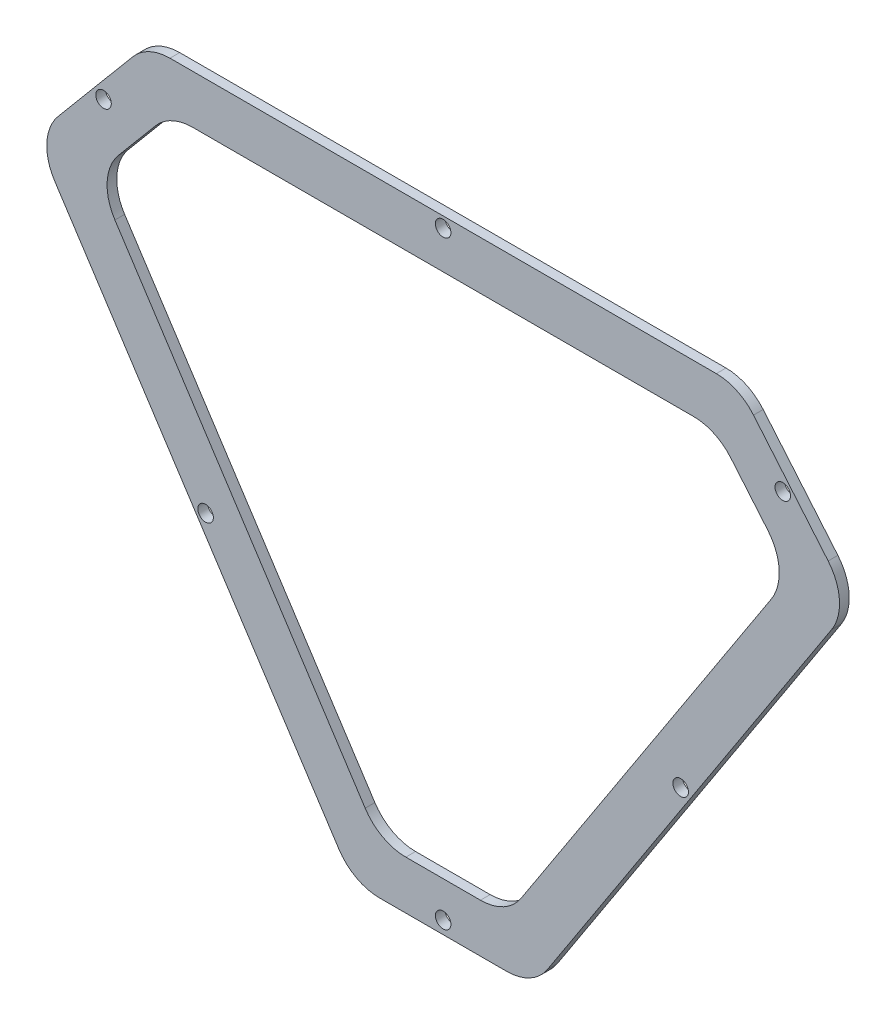
ISO-10303-21;
HEADER;
FILE_DESCRIPTION(('STEP AP214'),'2;1');
FILE_NAME('part.step','',(''),(''),'','','');
FILE_SCHEMA(('AUTOMOTIVE_DESIGN { 1 0 10303 214 1 1 1 1 }'));
ENDSEC;
DATA;
#1=APPLICATION_CONTEXT('core data for automotive mechanical design processes');
#2=APPLICATION_PROTOCOL_DEFINITION('international standard','automotive_design',2000,#1);
#3=PRODUCT_CONTEXT('',#1,'mechanical');
#4=PRODUCT('Part','Part','',(#3));
#5=PRODUCT_RELATED_PRODUCT_CATEGORY('part','',(#4));
#6=PRODUCT_DEFINITION_FORMATION('','',#4);
#7=PRODUCT_DEFINITION_CONTEXT('part definition',#1,'design');
#8=PRODUCT_DEFINITION('design','',#6,#7);
#9=PRODUCT_DEFINITION_SHAPE('','',#8);
#10=(LENGTH_UNIT() NAMED_UNIT(*) SI_UNIT(.MILLI.,.METRE.));
#11=(NAMED_UNIT(*) PLANE_ANGLE_UNIT() SI_UNIT($,.RADIAN.));
#12=(NAMED_UNIT(*) SI_UNIT($,.STERADIAN.) SOLID_ANGLE_UNIT());
#13=UNCERTAINTY_MEASURE_WITH_UNIT(LENGTH_MEASURE(1.E-05),#10,'distance_accuracy_value','');
#14=(GEOMETRIC_REPRESENTATION_CONTEXT(3) GLOBAL_UNCERTAINTY_ASSIGNED_CONTEXT((#13)) GLOBAL_UNIT_ASSIGNED_CONTEXT((#10,
#11,#12)) REPRESENTATION_CONTEXT('',''));
#15=CARTESIAN_POINT('',(0.,0.,0.));
#16=DIRECTION('',(0.,0.,1.));
#17=DIRECTION('',(1.,0.,0.));
#18=AXIS2_PLACEMENT_3D('',#15,#16,#17);
#19=CARTESIAN_POINT('',(-64.0302770326961,7.02578227157322,2.));
#20=DIRECTION('',(0.76604444311898,-0.642787609686537,0.));
#21=DIRECTION('',(0.642787609686537,0.76604444311898,0.));
#22=AXIS2_PLACEMENT_3D('',#19,#20,#21);
#23=PLANE('',#22);
#24=DIRECTION('',(-0.642787609686537,-0.76604444311898,0.));
#25=VECTOR('',#24,1.);
#26=CARTESIAN_POINT('',(-64.0302770326961,7.02578227157322,2.));
#27=LINE('',#26,#25);
#28=CARTESIAN_POINT('',(-43.8769392376704,31.0435949915599,2.));
#29=VERTEX_POINT('',#28);
#30=CARTESIAN_POINT('',(-59.2676486920447,12.7016617067355,2.));
#31=VERTEX_POINT('',#30);
#32=EDGE_CURVE('E216',#29,#31,#27,.T.);
#33=ORIENTED_EDGE('',*,*,#32,.F.);
#34=DIRECTION('',(0.,0.,-1.));
#35=VECTOR('',#34,1.);
#36=CARTESIAN_POINT('',(-43.8769392376704,31.0435949915599,2.));
#37=LINE('',#36,#35);
#38=CARTESIAN_POINT('',(-43.8769392376704,31.0435949915599,0.));
#39=VERTEX_POINT('',#38);
#40=EDGE_CURVE('E201',#29,#39,#37,.T.);
#41=ORIENTED_EDGE('',*,*,#40,.T.);
#42=DIRECTION('',(-0.642787609686537,-0.76604444311898,0.));
#43=VECTOR('',#42,1.);
#44=CARTESIAN_POINT('',(-64.0302770326961,7.02578227157322,0.));
#45=LINE('',#44,#43);
#46=CARTESIAN_POINT('',(-59.2676486920447,12.7016617067355,0.));
#47=VERTEX_POINT('',#46);
#48=EDGE_CURVE('E213',#39,#47,#45,.T.);
#49=ORIENTED_EDGE('',*,*,#48,.T.);
#50=DIRECTION('',(0.,0.,-1.));
#51=VECTOR('',#50,1.);
#52=CARTESIAN_POINT('',(-59.2676486920447,12.7016617067355,2.));
#53=LINE('',#52,#51);
#54=EDGE_CURVE('E218',#47,#31,#53,.F.);
#55=ORIENTED_EDGE('',*,*,#54,.T.);
#56=EDGE_LOOP('',(#33,#41,#49,#55));
#57=FACE_BOUND('',#56,.T.);
#58=ADVANCED_FACE('F33',(#57),#23,.F.);
#59=CARTESIAN_POINT('',(1.54524915373525,-93.6745327572285,2.));
#60=DIRECTION('',(0.837985801090183,0.545692035099692,0.));
#61=DIRECTION('',(-0.545692035099692,0.837985801090183,0.));
#62=AXIS2_PLACEMENT_3D('',#59,#60,#61);
#63=PLANE('',#62);
#64=DIRECTION('',(0.545692035099692,-0.837985801090183,0.));
#65=VECTOR('',#64,1.);
#66=CARTESIAN_POINT('',(1.54524915373525,-93.6745327572285,2.));
#67=LINE('',#66,#65);
#68=CARTESIAN_POINT('',(-59.9870622717568,0.816865258873201,2.));
#69=VERTEX_POINT('',#68);
#70=CARTESIAN_POINT('',(-1.41318090087814,-89.1314531082255,2.));
#71=VERTEX_POINT('',#70);
#72=EDGE_CURVE('E381',#69,#71,#67,.T.);
#73=ORIENTED_EDGE('',*,*,#72,.F.);
#74=DIRECTION('',(0.,0.,-1.));
#75=VECTOR('',#74,1.);
#76=CARTESIAN_POINT('',(-59.9870622717568,0.816865258873173,2.));
#77=LINE('',#76,#75);
#78=CARTESIAN_POINT('',(-59.9870622717568,0.816865258873201,0.));
#79=VERTEX_POINT('',#78);
#80=EDGE_CURVE('E271',#69,#79,#77,.T.);
#81=ORIENTED_EDGE('',*,*,#80,.T.);
#82=DIRECTION('',(0.545692035099692,-0.837985801090183,0.));
#83=VECTOR('',#82,1.);
#84=CARTESIAN_POINT('',(1.54524915373525,-93.6745327572285,0.));
#85=LINE('',#84,#83);
#86=CARTESIAN_POINT('',(-1.41318090087814,-89.1314531082255,0.));
#87=VERTEX_POINT('',#86);
#88=EDGE_CURVE('E222',#79,#87,#85,.T.);
#89=ORIENTED_EDGE('',*,*,#88,.T.);
#90=DIRECTION('',(0.,0.,-1.));
#91=VECTOR('',#90,1.);
#92=CARTESIAN_POINT('',(-1.41318090087815,-89.1314531082255,2.));
#93=LINE('',#92,#91);
#94=EDGE_CURVE('E269',#87,#71,#93,.F.);
#95=ORIENTED_EDGE('',*,*,#94,.T.);
#96=EDGE_LOOP('',(#73,#81,#89,#95));
#97=FACE_BOUND('',#96,.T.);
#98=ADVANCED_FACE('F431',(#97),#63,.F.);
#99=CARTESIAN_POINT('',(38.6179775263805,-93.6745327572285,2.));
#100=DIRECTION('',(0.,1.,0.));
#101=DIRECTION('',(0.,0.,1.));
#102=AXIS2_PLACEMENT_3D('',#99,#100,#101);
#103=PLANE('',#102);
#104=DIRECTION('',(1.,0.,0.));
#105=VECTOR('',#104,1.);
#106=CARTESIAN_POINT('',(38.6179775263805,-93.6745327572285,2.));
#107=LINE('',#106,#105);
#108=CARTESIAN_POINT('',(6.96667711002369,-93.6745327572285,2.));
#109=VERTEX_POINT('',#108);
#110=CARTESIAN_POINT('',(33.196549570092,-93.6745327572285,2.));
#111=VERTEX_POINT('',#110);
#112=EDGE_CURVE('E384',#109,#111,#107,.T.);
#113=ORIENTED_EDGE('',*,*,#112,.F.);
#114=DIRECTION('',(0.,0.,-1.));
#115=VECTOR('',#114,1.);
#116=CARTESIAN_POINT('',(6.96667711002369,-93.6745327572285,2.));
#117=LINE('',#116,#115);
#118=CARTESIAN_POINT('',(6.96667711002369,-93.6745327572285,0.));
#119=VERTEX_POINT('',#118);
#120=EDGE_CURVE('E276',#109,#119,#117,.T.);
#121=ORIENTED_EDGE('',*,*,#120,.T.);
#122=DIRECTION('',(1.,0.,0.));
#123=VECTOR('',#122,1.);
#124=CARTESIAN_POINT('',(38.6179775263805,-93.6745327572285,0.));
#125=LINE('',#124,#123);
#126=CARTESIAN_POINT('',(33.196549570092,-93.6745327572285,0.));
#127=VERTEX_POINT('',#126);
#128=EDGE_CURVE('E226',#119,#127,#125,.T.);
#129=ORIENTED_EDGE('',*,*,#128,.T.);
#130=DIRECTION('',(0.,0.,-1.));
#131=VECTOR('',#130,1.);
#132=CARTESIAN_POINT('',(33.196549570092,-93.6745327572285,2.));
#133=LINE('',#132,#131);
#134=EDGE_CURVE('E274',#127,#111,#133,.F.);
#135=ORIENTED_EDGE('',*,*,#134,.T.);
#136=EDGE_LOOP('',(#113,#121,#129,#135));
#137=FACE_BOUND('',#136,.T.);
#138=ADVANCED_FACE('F423',(#137),#103,.F.);
#139=CARTESIAN_POINT('',(104.193503712812,7.02578227157324,2.));
#140=DIRECTION('',(-0.837985801090183,0.545692035099692,0.));
#141=DIRECTION('',(-0.545692035099692,-0.837985801090183,0.));
#142=AXIS2_PLACEMENT_3D('',#139,#140,#141);
#143=PLANE('',#142);
#144=DIRECTION('',(0.545692035099692,0.837985801090183,0.));
#145=VECTOR('',#144,1.);
#146=CARTESIAN_POINT('',(104.193503712812,7.02578227157324,2.));
#147=LINE('',#146,#145);
#148=CARTESIAN_POINT('',(41.5764075809939,-89.1314531082255,2.));
#149=VERTEX_POINT('',#148);
#150=CARTESIAN_POINT('',(100.150288951873,0.816865258873222,2.));
#151=VERTEX_POINT('',#150);
#152=EDGE_CURVE('E387',#149,#151,#147,.T.);
#153=ORIENTED_EDGE('',*,*,#152,.F.);
#154=DIRECTION('',(0.,0.,-1.));
#155=VECTOR('',#154,1.);
#156=CARTESIAN_POINT('',(41.5764075809939,-89.1314531082255,2.));
#157=LINE('',#156,#155);
#158=CARTESIAN_POINT('',(41.5764075809939,-89.1314531082255,0.));
#159=VERTEX_POINT('',#158);
#160=EDGE_CURVE('E281',#149,#159,#157,.T.);
#161=ORIENTED_EDGE('',*,*,#160,.T.);
#162=DIRECTION('',(0.545692035099692,0.837985801090183,0.));
#163=VECTOR('',#162,1.);
#164=CARTESIAN_POINT('',(104.193503712812,7.02578227157324,0.));
#165=LINE('',#164,#163);
#166=CARTESIAN_POINT('',(100.150288951873,0.816865258873222,0.));
#167=VERTEX_POINT('',#166);
#168=EDGE_CURVE('E237',#159,#167,#165,.T.);
#169=ORIENTED_EDGE('',*,*,#168,.T.);
#170=DIRECTION('',(0.,0.,-1.));
#171=VECTOR('',#170,1.);
#172=CARTESIAN_POINT('',(100.150288951873,0.816865258873221,2.));
#173=LINE('',#172,#171);
#174=EDGE_CURVE('E279',#167,#151,#173,.F.);
#175=ORIENTED_EDGE('',*,*,#174,.T.);
#176=EDGE_LOOP('',(#153,#161,#169,#175));
#177=FACE_BOUND('',#176,.T.);
#178=ADVANCED_FACE('F414',(#177),#143,.F.);
#179=CARTESIAN_POINT('',(81.0427980681464,34.6157188946945,2.));
#180=DIRECTION('',(-0.76604444311898,-0.642787609686538,0.));
#181=DIRECTION('',(0.642787609686538,-0.76604444311898,0.));
#182=AXIS2_PLACEMENT_3D('',#179,#180,#181);
#183=PLANE('',#182);
#184=DIRECTION('',(-0.642787609686538,0.76604444311898,0.));
#185=VECTOR('',#184,1.);
#186=CARTESIAN_POINT('',(81.0427980681464,34.6157188946945,2.));
#187=LINE('',#186,#185);
#188=CARTESIAN_POINT('',(99.4308753721605,12.7016617067355,2.));
#189=VERTEX_POINT('',#188);
#190=CARTESIAN_POINT('',(84.0401659177861,31.0435949915599,2.));
#191=VERTEX_POINT('',#190);
#192=EDGE_CURVE('E389',#189,#191,#187,.T.);
#193=ORIENTED_EDGE('',*,*,#192,.F.);
#194=DIRECTION('',(0.,0.,-1.));
#195=VECTOR('',#194,1.);
#196=CARTESIAN_POINT('',(99.4308753721605,12.7016617067355,2.));
#197=LINE('',#196,#195);
#198=CARTESIAN_POINT('',(99.4308753721605,12.7016617067355,0.));
#199=VERTEX_POINT('',#198);
#200=EDGE_CURVE('E286',#189,#199,#197,.T.);
#201=ORIENTED_EDGE('',*,*,#200,.T.);
#202=DIRECTION('',(-0.642787609686538,0.76604444311898,0.));
#203=VECTOR('',#202,1.);
#204=CARTESIAN_POINT('',(81.0427980681464,34.6157188946945,0.));
#205=LINE('',#204,#203);
#206=CARTESIAN_POINT('',(84.0401659177861,31.0435949915599,0.));
#207=VERTEX_POINT('',#206);
#208=EDGE_CURVE('E240',#199,#207,#205,.T.);
#209=ORIENTED_EDGE('',*,*,#208,.T.);
#210=DIRECTION('',(0.,0.,-1.));
#211=VECTOR('',#210,1.);
#212=CARTESIAN_POINT('',(84.0401659177861,31.0435949915599,2.));
#213=LINE('',#212,#211);
#214=EDGE_CURVE('E284',#207,#191,#213,.F.);
#215=ORIENTED_EDGE('',*,*,#214,.T.);
#216=EDGE_LOOP('',(#193,#201,#209,#215));
#217=FACE_BOUND('',#216,.T.);
#218=ADVANCED_FACE('F405',(#217),#183,.F.);
#219=CARTESIAN_POINT('',(-40.8795713880306,34.6157188946945,2.));
#220=DIRECTION('',(0.,-1.,0.));
#221=DIRECTION('',(1.,0.,0.));
#222=AXIS2_PLACEMENT_3D('',#219,#220,#221);
#223=PLANE('',#222);
#224=DIRECTION('',(-1.,0.,0.));
#225=VECTOR('',#224,1.);
#226=CARTESIAN_POINT('',(-40.8795713880306,34.6157188946945,0.));
#227=LINE('',#226,#225);
#228=CARTESIAN_POINT('',(76.3797214865963,34.6157188946945,0.));
#229=VERTEX_POINT('',#228);
#230=CARTESIAN_POINT('',(-36.2164948064806,34.6157188946945,0.));
#231=VERTEX_POINT('',#230);
#232=EDGE_CURVE('E243',#229,#231,#227,.T.);
#233=ORIENTED_EDGE('',*,*,#232,.T.);
#234=DIRECTION('',(0.,0.,-1.));
#235=VECTOR('',#234,1.);
#236=CARTESIAN_POINT('',(-36.2164948064806,34.6157188946945,2.));
#237=LINE('',#236,#235);
#238=CARTESIAN_POINT('',(-36.2164948064806,34.6157188946945,2.));
#239=VERTEX_POINT('',#238);
#240=EDGE_CURVE('E202',#231,#239,#237,.F.);
#241=ORIENTED_EDGE('',*,*,#240,.T.);
#242=DIRECTION('',(-1.,0.,0.));
#243=VECTOR('',#242,1.);
#244=CARTESIAN_POINT('',(-40.8795713880306,34.6157188946945,2.));
#245=LINE('',#244,#243);
#246=CARTESIAN_POINT('',(76.3797214865963,34.6157188946945,2.));
#247=VERTEX_POINT('',#246);
#248=EDGE_CURVE('E232',#247,#239,#245,.T.);
#249=ORIENTED_EDGE('',*,*,#248,.F.);
#250=DIRECTION('',(0.,0.,-1.));
#251=VECTOR('',#250,1.);
#252=CARTESIAN_POINT('',(76.3797214865963,34.6157188946945,2.));
#253=LINE('',#252,#251);
#254=EDGE_CURVE('E207',#247,#229,#253,.T.);
#255=ORIENTED_EDGE('',*,*,#254,.T.);
#256=EDGE_LOOP('',(#233,#241,#249,#255));
#257=FACE_BOUND('',#256,.T.);
#258=ADVANCED_FACE('F399',(#257),#223,.F.);
#259=CARTESIAN_POINT('',(0.,0.,2.));
#260=DIRECTION('',(0.,0.,-1.));
#261=DIRECTION('',(-1.,0.,0.));
#262=AXIS2_PLACEMENT_3D('',#259,#260,#261);
#263=PLANE('',#262);
#264=CARTESIAN_POINT('',(-49.913475097361,20.4269392748569,2.));
#265=DIRECTION('',(0.,0.,1.));
#266=DIRECTION('',(1.,0.,0.));
#267=AXIS2_PLACEMENT_3D('',#264,#265,#266);
#268=CIRCLE('',#267,1.6);
#269=CARTESIAN_POINT('',(-48.313475097361,20.4269392748569,2.));
#270=VERTEX_POINT('',#269);
#271=EDGE_CURVE('E342',#270,#270,#268,.T.);
#272=ORIENTED_EDGE('',*,*,#271,.F.);
#273=EDGE_LOOP('',(#272));
#274=FACE_BOUND('',#273,.T.);
#275=CARTESIAN_POINT('',(69.0360512746297,-42.9317838870013,2.));
#276=DIRECTION('',(0.,0.,1.));
#277=DIRECTION('',(1.,0.,0.));
#278=AXIS2_PLACEMENT_3D('',#275,#276,#277);
#279=CIRCLE('',#278,1.60000000000001);
#280=CARTESIAN_POINT('',(70.6360512746297,-42.9317838870013,2.));
#281=VERTEX_POINT('',#280);
#282=EDGE_CURVE('E520',#281,#281,#279,.T.);
#283=ORIENTED_EDGE('',*,*,#282,.F.);
#284=EDGE_LOOP('',(#283));
#285=FACE_BOUND('',#284,.T.);
#286=CARTESIAN_POINT('',(90.0767017774767,20.4269392748569,2.));
#287=DIRECTION('',(0.,0.,1.));
#288=DIRECTION('',(1.,0.,0.));
#289=AXIS2_PLACEMENT_3D('',#286,#287,#288);
#290=CIRCLE('',#289,1.6);
#291=CARTESIAN_POINT('',(91.6767017774767,20.4269392748569,2.));
#292=VERTEX_POINT('',#291);
#293=EDGE_CURVE('E522',#292,#292,#290,.T.);
#294=ORIENTED_EDGE('',*,*,#293,.F.);
#295=EDGE_LOOP('',(#294));
#296=FACE_BOUND('',#295,.T.);
#297=CARTESIAN_POINT('',(20.0816133400579,32.4157188946945,2.));
#298=DIRECTION('',(0.,0.,1.));
#299=DIRECTION('',(1.,0.,0.));
#300=AXIS2_PLACEMENT_3D('',#297,#298,#299);
#301=CIRCLE('',#300,1.6);
#302=CARTESIAN_POINT('',(21.6816133400579,32.4157188946945,2.));
#303=VERTEX_POINT('',#302);
#304=EDGE_CURVE('E526',#303,#303,#301,.T.);
#305=ORIENTED_EDGE('',*,*,#304,.F.);
#306=EDGE_LOOP('',(#305));
#307=FACE_BOUND('',#306,.T.);
#308=CARTESIAN_POINT('',(-28.8728245945139,-42.9317838870013,2.));
#309=DIRECTION('',(0.,0.,1.));
#310=DIRECTION('',(1.,0.,0.));
#311=AXIS2_PLACEMENT_3D('',#308,#309,#310);
#312=CIRCLE('',#311,1.6);
#313=CARTESIAN_POINT('',(-27.2728245945139,-42.9317838870013,2.));
#314=VERTEX_POINT('',#313);
#315=EDGE_CURVE('E517',#314,#314,#312,.T.);
#316=ORIENTED_EDGE('',*,*,#315,.F.);
#317=EDGE_LOOP('',(#316));
#318=FACE_BOUND('',#317,.T.);
#319=CARTESIAN_POINT('',(20.0816133400579,-91.0580734163043,2.));
#320=DIRECTION('',(0.,0.,1.));
#321=DIRECTION('',(1.,0.,0.));
#322=AXIS2_PLACEMENT_3D('',#319,#320,#321);
#323=CIRCLE('',#322,1.6);
#324=CARTESIAN_POINT('',(21.6816133400579,-91.0580734163043,2.));
#325=VERTEX_POINT('',#324);
#326=EDGE_CURVE('E514',#325,#325,#323,.T.);
#327=ORIENTED_EDGE('',*,*,#326,.F.);
#328=EDGE_LOOP('',(#327));
#329=FACE_BOUND('',#328,.T.);
#330=DIRECTION('',(-0.642787609686537,-0.76604444311898,0.));
#331=VECTOR('',#330,1.);
#332=CARTESIAN_POINT('',(-36.2164948064806,24.6157188946945,2.));
#333=LINE('',#332,#331);
#334=CARTESIAN_POINT('',(-39.2138626561204,21.0435949915599,2.));
#335=VERTEX_POINT('',#334);
#336=CARTESIAN_POINT('',(-46.8445759202036,11.9496650450324,2.));
#337=VERTEX_POINT('',#336);
#338=EDGE_CURVE('E359',#335,#337,#333,.T.);
#339=ORIENTED_EDGE('',*,*,#338,.F.);
#340=CARTESIAN_POINT('',(-31.5534182249306,14.6157188946945,2.));
#341=DIRECTION('',(0.,0.,-1.));
#342=DIRECTION('',(-1.,0.,0.));
#343=AXIS2_PLACEMENT_3D('',#340,#341,#342);
#344=CIRCLE('',#343,10.);
#345=CARTESIAN_POINT('',(-31.5534182249306,24.6157188946945,2.));
#346=VERTEX_POINT('',#345);
#347=EDGE_CURVE('E334',#335,#346,#344,.T.);
#348=ORIENTED_EDGE('',*,*,#347,.T.);
#349=DIRECTION('',(-1.,0.,0.));
#350=VECTOR('',#349,1.);
#351=CARTESIAN_POINT('',(-36.2164948064806,24.6157188946945,2.));
#352=LINE('',#351,#350);
#353=CARTESIAN_POINT('',(71.7166449050463,24.6157188946945,2.));
#354=VERTEX_POINT('',#353);
#355=EDGE_CURVE('E355',#354,#346,#352,.T.);
#356=ORIENTED_EDGE('',*,*,#355,.F.);
#357=CARTESIAN_POINT('',(71.7166449050463,14.6157188946945,2.));
#358=DIRECTION('',(0.,0.,-1.));
#359=DIRECTION('',(-1.,0.,0.));
#360=AXIS2_PLACEMENT_3D('',#357,#358,#359);
#361=CIRCLE('',#360,10.);
#362=CARTESIAN_POINT('',(79.3770893362361,21.0435949915599,2.));
#363=VERTEX_POINT('',#362);
#364=EDGE_CURVE('E318',#354,#363,#361,.T.);
#365=ORIENTED_EDGE('',*,*,#364,.T.);
#366=DIRECTION('',(-0.642787609686537,0.76604444311898,0.));
#367=VECTOR('',#366,1.);
#368=CARTESIAN_POINT('',(76.3797214865963,24.6157188946945,2.));
#369=LINE('',#368,#367);
#370=CARTESIAN_POINT('',(87.0078026003193,11.9496650450324,2.));
#371=VERTEX_POINT('',#370);
#372=EDGE_CURVE('E376',#371,#363,#369,.T.);
#373=ORIENTED_EDGE('',*,*,#372,.F.);
#374=CARTESIAN_POINT('',(79.3473581691295,5.52178894816703,2.));
#375=DIRECTION('',(0.,0.,-1.));
#376=DIRECTION('',(-1.,0.,0.));
#377=AXIS2_PLACEMENT_3D('',#374,#375,#376);
#378=CIRCLE('',#377,10.);
#379=CARTESIAN_POINT('',(87.7272161800314,0.0648685971701077,2.));
#380=VERTEX_POINT('',#379);
#381=EDGE_CURVE('E322',#371,#380,#378,.T.);
#382=ORIENTED_EDGE('',*,*,#381,.T.);
#383=DIRECTION('',(0.545692035099692,0.837985801090183,0.));
#384=VECTOR('',#383,1.);
#385=CARTESIAN_POINT('',(91.7704309409707,6.27378560987013,2.));
#386=LINE('',#385,#384);
#387=CARTESIAN_POINT('',(36.1549796247054,-79.1314531082255,2.));
#388=VERTEX_POINT('',#387);
#389=EDGE_CURVE('E373',#388,#380,#386,.T.);
#390=ORIENTED_EDGE('',*,*,#389,.F.);
#391=CARTESIAN_POINT('',(27.7751216138036,-73.6745327572285,2.));
#392=DIRECTION('',(0.,0.,-1.));
#393=DIRECTION('',(-1.,0.,0.));
#394=AXIS2_PLACEMENT_3D('',#391,#392,#393);
#395=CIRCLE('',#394,10.);
#396=CARTESIAN_POINT('',(27.7751216138036,-83.6745327572285,2.));
#397=VERTEX_POINT('',#396);
#398=EDGE_CURVE('E326',#388,#397,#395,.T.);
#399=ORIENTED_EDGE('',*,*,#398,.T.);
#400=DIRECTION('',(1.,0.,0.));
#401=VECTOR('',#400,1.);
#402=CARTESIAN_POINT('',(6.96667711002369,-83.6745327572285,2.));
#403=LINE('',#402,#401);
#404=CARTESIAN_POINT('',(12.3881050663121,-83.6745327572285,2.));
#405=VERTEX_POINT('',#404);
#406=EDGE_CURVE('E370',#405,#397,#403,.T.);
#407=ORIENTED_EDGE('',*,*,#406,.F.);
#408=CARTESIAN_POINT('',(12.3881050663121,-73.6745327572285,2.));
#409=DIRECTION('',(0.,0.,-1.));
#410=DIRECTION('',(-1.,0.,0.));
#411=AXIS2_PLACEMENT_3D('',#408,#409,#410);
#412=CIRCLE('',#411,10.);
#413=CARTESIAN_POINT('',(4.00824705541027,-79.1314531082254,2.));
#414=VERTEX_POINT('',#413);
#415=EDGE_CURVE('E330',#405,#414,#412,.T.);
#416=ORIENTED_EDGE('',*,*,#415,.T.);
#417=DIRECTION('',(0.545692035099692,-0.837985801090183,0.));
#418=VECTOR('',#417,1.);
#419=CARTESIAN_POINT('',(-51.6072042608549,6.27378560987011,2.));
#420=LINE('',#419,#418);
#421=CARTESIAN_POINT('',(-47.5639894999156,0.0648685971700834,2.));
#422=VERTEX_POINT('',#421);
#423=EDGE_CURVE('E364',#422,#414,#420,.T.);
#424=ORIENTED_EDGE('',*,*,#423,.F.);
#425=CARTESIAN_POINT('',(-39.1841314890138,5.521788948167,2.));
#426=DIRECTION('',(0.,0.,-1.));
#427=DIRECTION('',(-1.,0.,0.));
#428=AXIS2_PLACEMENT_3D('',#425,#426,#427);
#429=CIRCLE('',#428,10.);
#430=EDGE_CURVE('E42',#422,#337,#429,.T.);
#431=ORIENTED_EDGE('',*,*,#430,.T.);
#432=EDGE_LOOP('',(#339,#348,#356,#365,#373,#382,#390,#399,#407,#416,#424,#431));
#433=FACE_BOUND('',#432,.T.);
#434=ORIENTED_EDGE('',*,*,#248,.T.);
#435=CARTESIAN_POINT('',(-36.2164948064806,24.6157188946945,2.));
#436=DIRECTION('',(0.,0.,-1.));
#437=DIRECTION('',(-1.,0.,0.));
#438=AXIS2_PLACEMENT_3D('',#435,#436,#437);
#439=CIRCLE('',#438,10.);
#440=EDGE_CURVE('E267',#239,#29,#439,.F.);
#441=ORIENTED_EDGE('',*,*,#440,.T.);
#442=ORIENTED_EDGE('',*,*,#32,.T.);
#443=CARTESIAN_POINT('',(-51.6072042608549,6.27378560987012,2.));
#444=DIRECTION('',(0.,0.,-1.));
#445=DIRECTION('',(-1.,0.,0.));
#446=AXIS2_PLACEMENT_3D('',#443,#444,#445);
#447=CIRCLE('',#446,10.);
#448=EDGE_CURVE('E265',#31,#69,#447,.F.);
#449=ORIENTED_EDGE('',*,*,#448,.T.);
#450=ORIENTED_EDGE('',*,*,#72,.T.);
#451=CARTESIAN_POINT('',(6.96667711002369,-83.6745327572285,2.));
#452=DIRECTION('',(0.,0.,-1.));
#453=DIRECTION('',(-1.,0.,0.));
#454=AXIS2_PLACEMENT_3D('',#451,#452,#453);
#455=CIRCLE('',#454,10.);
#456=EDGE_CURVE('E263',#71,#109,#455,.F.);
#457=ORIENTED_EDGE('',*,*,#456,.T.);
#458=ORIENTED_EDGE('',*,*,#112,.T.);
#459=CARTESIAN_POINT('',(33.196549570092,-83.6745327572285,2.));
#460=DIRECTION('',(0.,0.,-1.));
#461=DIRECTION('',(-1.,0.,0.));
#462=AXIS2_PLACEMENT_3D('',#459,#460,#461);
#463=CIRCLE('',#462,10.);
#464=EDGE_CURVE('E261',#111,#149,#463,.F.);
#465=ORIENTED_EDGE('',*,*,#464,.T.);
#466=ORIENTED_EDGE('',*,*,#152,.T.);
#467=CARTESIAN_POINT('',(91.7704309409707,6.27378560987014,2.));
#468=DIRECTION('',(0.,0.,-1.));
#469=DIRECTION('',(-1.,0.,0.));
#470=AXIS2_PLACEMENT_3D('',#467,#468,#469);
#471=CIRCLE('',#470,10.);
#472=EDGE_CURVE('E259',#151,#189,#471,.F.);
#473=ORIENTED_EDGE('',*,*,#472,.T.);
#474=ORIENTED_EDGE('',*,*,#192,.T.);
#475=CARTESIAN_POINT('',(76.3797214865963,24.6157188946945,2.));
#476=DIRECTION('',(0.,0.,-1.));
#477=DIRECTION('',(-1.,0.,0.));
#478=AXIS2_PLACEMENT_3D('',#475,#476,#477);
#479=CIRCLE('',#478,10.);
#480=EDGE_CURVE('E257',#191,#247,#479,.F.);
#481=ORIENTED_EDGE('',*,*,#480,.T.);
#482=EDGE_LOOP('',(#434,#441,#442,#449,#450,#457,#458,#465,#466,#473,#474,#481));
#483=FACE_BOUND('',#482,.T.);
#484=ADVANCED_FACE('F396',(#274,#285,#296,#307,#318,#329,#433,#483),#263,.F.);
#485=CARTESIAN_POINT('',(0.,0.,0.));
#486=DIRECTION('',(0.,0.,-1.));
#487=DIRECTION('',(-1.,0.,0.));
#488=AXIS2_PLACEMENT_3D('',#485,#486,#487);
#489=PLANE('',#488);
#490=CARTESIAN_POINT('',(-49.913475097361,20.4269392748569,0.));
#491=DIRECTION('',(0.,0.,-1.));
#492=DIRECTION('',(-1.,0.,0.));
#493=AXIS2_PLACEMENT_3D('',#490,#491,#492);
#494=CIRCLE('',#493,1.6);
#495=CARTESIAN_POINT('',(-51.513475097361,20.4269392748569,0.));
#496=VERTEX_POINT('',#495);
#497=EDGE_CURVE('E37',#496,#496,#494,.T.);
#498=ORIENTED_EDGE('',*,*,#497,.F.);
#499=EDGE_LOOP('',(#498));
#500=FACE_BOUND('',#499,.T.);
#501=CARTESIAN_POINT('',(69.0360512746297,-42.9317838870013,0.));
#502=DIRECTION('',(0.,0.,-1.));
#503=DIRECTION('',(-1.,0.,0.));
#504=AXIS2_PLACEMENT_3D('',#501,#502,#503);
#505=CIRCLE('',#504,1.60000000000001);
#506=CARTESIAN_POINT('',(67.4360512746297,-42.9317838870013,0.));
#507=VERTEX_POINT('',#506);
#508=EDGE_CURVE('E350',#507,#507,#505,.T.);
#509=ORIENTED_EDGE('',*,*,#508,.F.);
#510=EDGE_LOOP('',(#509));
#511=FACE_BOUND('',#510,.T.);
#512=CARTESIAN_POINT('',(90.0767017774767,20.4269392748569,0.));
#513=DIRECTION('',(0.,0.,-1.));
#514=DIRECTION('',(-1.,0.,0.));
#515=AXIS2_PLACEMENT_3D('',#512,#513,#514);
#516=CIRCLE('',#515,1.6);
#517=CARTESIAN_POINT('',(88.4767017774767,20.4269392748569,0.));
#518=VERTEX_POINT('',#517);
#519=EDGE_CURVE('E348',#518,#518,#516,.T.);
#520=ORIENTED_EDGE('',*,*,#519,.F.);
#521=EDGE_LOOP('',(#520));
#522=FACE_BOUND('',#521,.T.);
#523=CARTESIAN_POINT('',(20.0816133400579,32.4157188946945,0.));
#524=DIRECTION('',(0.,0.,-1.));
#525=DIRECTION('',(-1.,0.,0.));
#526=AXIS2_PLACEMENT_3D('',#523,#524,#525);
#527=CIRCLE('',#526,1.6);
#528=CARTESIAN_POINT('',(18.4816133400579,32.4157188946945,0.));
#529=VERTEX_POINT('',#528);
#530=EDGE_CURVE('E345',#529,#529,#527,.T.);
#531=ORIENTED_EDGE('',*,*,#530,.F.);
#532=EDGE_LOOP('',(#531));
#533=FACE_BOUND('',#532,.T.);
#534=CARTESIAN_POINT('',(-28.8728245945139,-42.9317838870013,0.));
#535=DIRECTION('',(0.,0.,-1.));
#536=DIRECTION('',(-1.,0.,0.));
#537=AXIS2_PLACEMENT_3D('',#534,#535,#536);
#538=CIRCLE('',#537,1.6);
#539=CARTESIAN_POINT('',(-30.4728245945139,-42.9317838870013,0.));
#540=VERTEX_POINT('',#539);
#541=EDGE_CURVE('E341',#540,#540,#538,.T.);
#542=ORIENTED_EDGE('',*,*,#541,.F.);
#543=EDGE_LOOP('',(#542));
#544=FACE_BOUND('',#543,.T.);
#545=CARTESIAN_POINT('',(20.0816133400579,-91.0580734163043,0.));
#546=DIRECTION('',(0.,0.,-1.));
#547=DIRECTION('',(-1.,0.,0.));
#548=AXIS2_PLACEMENT_3D('',#545,#546,#547);
#549=CIRCLE('',#548,1.6);
#550=CARTESIAN_POINT('',(18.4816133400579,-91.0580734163043,0.));
#551=VERTEX_POINT('',#550);
#552=EDGE_CURVE('E338',#551,#551,#549,.T.);
#553=ORIENTED_EDGE('',*,*,#552,.F.);
#554=EDGE_LOOP('',(#553));
#555=FACE_BOUND('',#554,.T.);
#556=DIRECTION('',(-0.642787609686537,0.76604444311898,0.));
#557=VECTOR('',#556,1.);
#558=CARTESIAN_POINT('',(76.3797214865963,24.6157188946945,0.));
#559=LINE('',#558,#557);
#560=CARTESIAN_POINT('',(87.0078026003193,11.9496650450324,0.));
#561=VERTEX_POINT('',#560);
#562=CARTESIAN_POINT('',(79.3770893362361,21.0435949915599,0.));
#563=VERTEX_POINT('',#562);
#564=EDGE_CURVE('E223',#561,#563,#559,.T.);
#565=ORIENTED_EDGE('',*,*,#564,.T.);
#566=CARTESIAN_POINT('',(71.7166449050463,14.6157188946945,0.));
#567=DIRECTION('',(0.,0.,-1.));
#568=DIRECTION('',(-1.,0.,0.));
#569=AXIS2_PLACEMENT_3D('',#566,#567,#568);
#570=CIRCLE('',#569,10.);
#571=CARTESIAN_POINT('',(71.7166449050463,24.6157188946945,0.));
#572=VERTEX_POINT('',#571);
#573=EDGE_CURVE('E320',#563,#572,#570,.F.);
#574=ORIENTED_EDGE('',*,*,#573,.T.);
#575=DIRECTION('',(-1.,0.,0.));
#576=VECTOR('',#575,1.);
#577=CARTESIAN_POINT('',(-36.2164948064806,24.6157188946945,0.));
#578=LINE('',#577,#576);
#579=CARTESIAN_POINT('',(-31.5534182249306,24.6157188946945,0.));
#580=VERTEX_POINT('',#579);
#581=EDGE_CURVE('E379',#572,#580,#578,.T.);
#582=ORIENTED_EDGE('',*,*,#581,.T.);
#583=CARTESIAN_POINT('',(-31.5534182249306,14.6157188946945,0.));
#584=DIRECTION('',(0.,0.,-1.));
#585=DIRECTION('',(-1.,0.,0.));
#586=AXIS2_PLACEMENT_3D('',#583,#584,#585);
#587=CIRCLE('',#586,10.);
#588=CARTESIAN_POINT('',(-39.2138626561204,21.0435949915599,0.));
#589=VERTEX_POINT('',#588);
#590=EDGE_CURVE('E57',#580,#589,#587,.F.);
#591=ORIENTED_EDGE('',*,*,#590,.T.);
#592=DIRECTION('',(-0.642787609686537,-0.76604444311898,0.));
#593=VECTOR('',#592,1.);
#594=CARTESIAN_POINT('',(-36.2164948064806,24.6157188946945,0.));
#595=LINE('',#594,#593);
#596=CARTESIAN_POINT('',(-46.8445759202036,11.9496650450324,0.));
#597=VERTEX_POINT('',#596);
#598=EDGE_CURVE('E532',#589,#597,#595,.T.);
#599=ORIENTED_EDGE('',*,*,#598,.T.);
#600=CARTESIAN_POINT('',(-39.1841314890138,5.521788948167,0.));
#601=DIRECTION('',(0.,0.,-1.));
#602=DIRECTION('',(-1.,0.,0.));
#603=AXIS2_PLACEMENT_3D('',#600,#601,#602);
#604=CIRCLE('',#603,10.);
#605=CARTESIAN_POINT('',(-47.5639894999156,0.0648685971700834,0.));
#606=VERTEX_POINT('',#605);
#607=EDGE_CURVE('E11',#597,#606,#604,.F.);
#608=ORIENTED_EDGE('',*,*,#607,.T.);
#609=DIRECTION('',(0.545692035099692,-0.837985801090183,0.));
#610=VECTOR('',#609,1.);
#611=CARTESIAN_POINT('',(-51.6072042608549,6.27378560987011,0.));
#612=LINE('',#611,#610);
#613=CARTESIAN_POINT('',(4.00824705541027,-79.1314531082254,0.));
#614=VERTEX_POINT('',#613);
#615=EDGE_CURVE('E534',#606,#614,#612,.T.);
#616=ORIENTED_EDGE('',*,*,#615,.T.);
#617=CARTESIAN_POINT('',(12.3881050663121,-73.6745327572285,0.));
#618=DIRECTION('',(0.,0.,-1.));
#619=DIRECTION('',(-1.,0.,0.));
#620=AXIS2_PLACEMENT_3D('',#617,#618,#619);
#621=CIRCLE('',#620,10.);
#622=CARTESIAN_POINT('',(12.3881050663121,-83.6745327572285,0.));
#623=VERTEX_POINT('',#622);
#624=EDGE_CURVE('E332',#614,#623,#621,.F.);
#625=ORIENTED_EDGE('',*,*,#624,.T.);
#626=DIRECTION('',(1.,0.,0.));
#627=VECTOR('',#626,1.);
#628=CARTESIAN_POINT('',(6.96667711002369,-83.6745327572285,0.));
#629=LINE('',#628,#627);
#630=CARTESIAN_POINT('',(27.7751216138036,-83.6745327572285,0.));
#631=VERTEX_POINT('',#630);
#632=EDGE_CURVE('E537',#623,#631,#629,.T.);
#633=ORIENTED_EDGE('',*,*,#632,.T.);
#634=CARTESIAN_POINT('',(27.7751216138036,-73.6745327572285,0.));
#635=DIRECTION('',(0.,0.,-1.));
#636=DIRECTION('',(-1.,0.,0.));
#637=AXIS2_PLACEMENT_3D('',#634,#635,#636);
#638=CIRCLE('',#637,10.);
#639=CARTESIAN_POINT('',(36.1549796247054,-79.1314531082255,0.));
#640=VERTEX_POINT('',#639);
#641=EDGE_CURVE('E328',#631,#640,#638,.F.);
#642=ORIENTED_EDGE('',*,*,#641,.T.);
#643=DIRECTION('',(0.545692035099692,0.837985801090183,0.));
#644=VECTOR('',#643,1.);
#645=CARTESIAN_POINT('',(91.7704309409707,6.27378560987013,0.));
#646=LINE('',#645,#644);
#647=CARTESIAN_POINT('',(87.7272161800314,0.0648685971701077,0.));
#648=VERTEX_POINT('',#647);
#649=EDGE_CURVE('E229',#640,#648,#646,.T.);
#650=ORIENTED_EDGE('',*,*,#649,.T.);
#651=CARTESIAN_POINT('',(79.3473581691295,5.52178894816703,0.));
#652=DIRECTION('',(0.,0.,-1.));
#653=DIRECTION('',(-1.,0.,0.));
#654=AXIS2_PLACEMENT_3D('',#651,#652,#653);
#655=CIRCLE('',#654,10.);
#656=EDGE_CURVE('E324',#648,#561,#655,.F.);
#657=ORIENTED_EDGE('',*,*,#656,.T.);
#658=EDGE_LOOP('',(#565,#574,#582,#591,#599,#608,#616,#625,#633,#642,#650,#657));
#659=FACE_BOUND('',#658,.T.);
#660=ORIENTED_EDGE('',*,*,#48,.F.);
#661=CARTESIAN_POINT('',(-36.2164948064806,24.6157188946945,0.));
#662=DIRECTION('',(0.,0.,-1.));
#663=DIRECTION('',(-1.,0.,0.));
#664=AXIS2_PLACEMENT_3D('',#661,#662,#663);
#665=CIRCLE('',#664,10.);
#666=EDGE_CURVE('E197',#39,#231,#665,.T.);
#667=ORIENTED_EDGE('',*,*,#666,.T.);
#668=ORIENTED_EDGE('',*,*,#232,.F.);
#669=CARTESIAN_POINT('',(76.3797214865963,24.6157188946945,0.));
#670=DIRECTION('',(0.,0.,-1.));
#671=DIRECTION('',(-1.,0.,0.));
#672=AXIS2_PLACEMENT_3D('',#669,#670,#671);
#673=CIRCLE('',#672,10.);
#674=EDGE_CURVE('E217',#229,#207,#673,.T.);
#675=ORIENTED_EDGE('',*,*,#674,.T.);
#676=ORIENTED_EDGE('',*,*,#208,.F.);
#677=CARTESIAN_POINT('',(91.7704309409707,6.27378560987014,0.));
#678=DIRECTION('',(0.,0.,-1.));
#679=DIRECTION('',(-1.,0.,0.));
#680=AXIS2_PLACEMENT_3D('',#677,#678,#679);
#681=CIRCLE('',#680,10.);
#682=EDGE_CURVE('E247',#199,#167,#681,.T.);
#683=ORIENTED_EDGE('',*,*,#682,.T.);
#684=ORIENTED_EDGE('',*,*,#168,.F.);
#685=CARTESIAN_POINT('',(33.196549570092,-83.6745327572285,0.));
#686=DIRECTION('',(0.,0.,-1.));
#687=DIRECTION('',(-1.,0.,0.));
#688=AXIS2_PLACEMENT_3D('',#685,#686,#687);
#689=CIRCLE('',#688,10.);
#690=EDGE_CURVE('E249',#159,#127,#689,.T.);
#691=ORIENTED_EDGE('',*,*,#690,.T.);
#692=ORIENTED_EDGE('',*,*,#128,.F.);
#693=CARTESIAN_POINT('',(6.96667711002369,-83.6745327572285,0.));
#694=DIRECTION('',(0.,0.,-1.));
#695=DIRECTION('',(-1.,0.,0.));
#696=AXIS2_PLACEMENT_3D('',#693,#694,#695);
#697=CIRCLE('',#696,10.);
#698=EDGE_CURVE('E251',#119,#87,#697,.T.);
#699=ORIENTED_EDGE('',*,*,#698,.T.);
#700=ORIENTED_EDGE('',*,*,#88,.F.);
#701=CARTESIAN_POINT('',(-51.6072042608549,6.27378560987012,0.));
#702=DIRECTION('',(0.,0.,-1.));
#703=DIRECTION('',(-1.,0.,0.));
#704=AXIS2_PLACEMENT_3D('',#701,#702,#703);
#705=CIRCLE('',#704,10.);
#706=EDGE_CURVE('E208',#79,#47,#705,.T.);
#707=ORIENTED_EDGE('',*,*,#706,.T.);
#708=EDGE_LOOP('',(#660,#667,#668,#675,#676,#683,#684,#691,#692,#699,#700,#707));
#709=FACE_BOUND('',#708,.T.);
#710=ADVANCED_FACE('F220',(#500,#511,#522,#533,#544,#555,#659,#709),#489,.T.);
#711=CARTESIAN_POINT('',(-36.2164948064806,24.6157188946945,2.));
#712=DIRECTION('',(0.,0.,-1.));
#713=DIRECTION('',(-1.,0.,0.));
#714=AXIS2_PLACEMENT_3D('',#711,#712,#713);
#715=CYLINDRICAL_SURFACE('',#714,10.);
#716=ORIENTED_EDGE('',*,*,#440,.F.);
#717=ORIENTED_EDGE('',*,*,#240,.F.);
#718=ORIENTED_EDGE('',*,*,#666,.F.);
#719=ORIENTED_EDGE('',*,*,#40,.F.);
#720=EDGE_LOOP('',(#716,#717,#718,#719));
#721=FACE_BOUND('',#720,.T.);
#722=ADVANCED_FACE('F200',(#721),#715,.T.);
#723=CARTESIAN_POINT('',(-51.6072042608549,6.27378560987012,2.));
#724=DIRECTION('',(0.,0.,-1.));
#725=DIRECTION('',(-1.,0.,0.));
#726=AXIS2_PLACEMENT_3D('',#723,#724,#725);
#727=CYLINDRICAL_SURFACE('',#726,10.);
#728=ORIENTED_EDGE('',*,*,#448,.F.);
#729=ORIENTED_EDGE('',*,*,#54,.F.);
#730=ORIENTED_EDGE('',*,*,#706,.F.);
#731=ORIENTED_EDGE('',*,*,#80,.F.);
#732=EDGE_LOOP('',(#728,#729,#730,#731));
#733=FACE_BOUND('',#732,.T.);
#734=ADVANCED_FACE('F435',(#733),#727,.T.);
#735=CARTESIAN_POINT('',(6.96667711002369,-83.6745327572285,2.));
#736=DIRECTION('',(0.,0.,-1.));
#737=DIRECTION('',(-1.,0.,0.));
#738=AXIS2_PLACEMENT_3D('',#735,#736,#737);
#739=CYLINDRICAL_SURFACE('',#738,10.);
#740=ORIENTED_EDGE('',*,*,#456,.F.);
#741=ORIENTED_EDGE('',*,*,#94,.F.);
#742=ORIENTED_EDGE('',*,*,#698,.F.);
#743=ORIENTED_EDGE('',*,*,#120,.F.);
#744=EDGE_LOOP('',(#740,#741,#742,#743));
#745=FACE_BOUND('',#744,.T.);
#746=ADVANCED_FACE('F427',(#745),#739,.T.);
#747=CARTESIAN_POINT('',(33.196549570092,-83.6745327572285,2.));
#748=DIRECTION('',(0.,0.,-1.));
#749=DIRECTION('',(-1.,0.,0.));
#750=AXIS2_PLACEMENT_3D('',#747,#748,#749);
#751=CYLINDRICAL_SURFACE('',#750,10.);
#752=ORIENTED_EDGE('',*,*,#464,.F.);
#753=ORIENTED_EDGE('',*,*,#134,.F.);
#754=ORIENTED_EDGE('',*,*,#690,.F.);
#755=ORIENTED_EDGE('',*,*,#160,.F.);
#756=EDGE_LOOP('',(#752,#753,#754,#755));
#757=FACE_BOUND('',#756,.T.);
#758=ADVANCED_FACE('F418',(#757),#751,.T.);
#759=CARTESIAN_POINT('',(91.7704309409707,6.27378560987014,2.));
#760=DIRECTION('',(0.,0.,-1.));
#761=DIRECTION('',(-1.,0.,0.));
#762=AXIS2_PLACEMENT_3D('',#759,#760,#761);
#763=CYLINDRICAL_SURFACE('',#762,10.);
#764=ORIENTED_EDGE('',*,*,#472,.F.);
#765=ORIENTED_EDGE('',*,*,#174,.F.);
#766=ORIENTED_EDGE('',*,*,#682,.F.);
#767=ORIENTED_EDGE('',*,*,#200,.F.);
#768=EDGE_LOOP('',(#764,#765,#766,#767));
#769=FACE_BOUND('',#768,.T.);
#770=ADVANCED_FACE('F409',(#769),#763,.T.);
#771=CARTESIAN_POINT('',(76.3797214865963,24.6157188946945,2.));
#772=DIRECTION('',(0.,0.,-1.));
#773=DIRECTION('',(-1.,0.,0.));
#774=AXIS2_PLACEMENT_3D('',#771,#772,#773);
#775=CYLINDRICAL_SURFACE('',#774,10.);
#776=ORIENTED_EDGE('',*,*,#480,.F.);
#777=ORIENTED_EDGE('',*,*,#214,.F.);
#778=ORIENTED_EDGE('',*,*,#674,.F.);
#779=ORIENTED_EDGE('',*,*,#254,.F.);
#780=EDGE_LOOP('',(#776,#777,#778,#779));
#781=FACE_BOUND('',#780,.T.);
#782=ADVANCED_FACE('F401',(#781),#775,.T.);
#783=CARTESIAN_POINT('',(-36.2164948064806,24.6157188946945,0.));
#784=DIRECTION('',(0.,1.,0.));
#785=DIRECTION('',(-1.,0.,0.));
#786=AXIS2_PLACEMENT_3D('',#783,#784,#785);
#787=PLANE('',#786);
#788=ORIENTED_EDGE('',*,*,#581,.F.);
#789=DIRECTION('',(0.,0.,1.));
#790=VECTOR('',#789,1.);
#791=CARTESIAN_POINT('',(71.7166449050463,24.6157188946945,2.));
#792=LINE('',#791,#790);
#793=EDGE_CURVE('E291',#572,#354,#792,.T.);
#794=ORIENTED_EDGE('',*,*,#793,.T.);
#795=ORIENTED_EDGE('',*,*,#355,.T.);
#796=DIRECTION('',(0.,0.,1.));
#797=VECTOR('',#796,1.);
#798=CARTESIAN_POINT('',(-31.5534182249306,24.6157188946945,0.));
#799=LINE('',#798,#797);
#800=EDGE_CURVE('E289',#346,#580,#799,.F.);
#801=ORIENTED_EDGE('',*,*,#800,.T.);
#802=EDGE_LOOP('',(#788,#794,#795,#801));
#803=FACE_BOUND('',#802,.T.);
#804=ADVANCED_FACE('F465',(#803),#787,.F.);
#805=CARTESIAN_POINT('',(76.3797214865963,24.6157188946945,0.));
#806=DIRECTION('',(0.76604444311898,0.642787609686537,0.));
#807=DIRECTION('',(-0.642787609686537,0.76604444311898,0.));
#808=AXIS2_PLACEMENT_3D('',#805,#806,#807);
#809=PLANE('',#808);
#810=ORIENTED_EDGE('',*,*,#372,.T.);
#811=DIRECTION('',(0.,0.,1.));
#812=VECTOR('',#811,1.);
#813=CARTESIAN_POINT('',(79.3770893362361,21.0435949915599,0.));
#814=LINE('',#813,#812);
#815=EDGE_CURVE('E297',#363,#563,#814,.F.);
#816=ORIENTED_EDGE('',*,*,#815,.T.);
#817=ORIENTED_EDGE('',*,*,#564,.F.);
#818=DIRECTION('',(0.,0.,1.));
#819=VECTOR('',#818,1.);
#820=CARTESIAN_POINT('',(87.0078026003193,11.9496650450324,2.));
#821=LINE('',#820,#819);
#822=EDGE_CURVE('E294',#561,#371,#821,.T.);
#823=ORIENTED_EDGE('',*,*,#822,.T.);
#824=EDGE_LOOP('',(#810,#816,#817,#823));
#825=FACE_BOUND('',#824,.T.);
#826=ADVANCED_FACE('F468',(#825),#809,.F.);
#827=CARTESIAN_POINT('',(91.7704309409707,6.27378560987013,0.));
#828=DIRECTION('',(0.837985801090183,-0.545692035099692,0.));
#829=DIRECTION('',(0.545692035099692,0.837985801090183,0.));
#830=AXIS2_PLACEMENT_3D('',#827,#828,#829);
#831=PLANE('',#830);
#832=ORIENTED_EDGE('',*,*,#389,.T.);
#833=DIRECTION('',(0.,0.,1.));
#834=VECTOR('',#833,1.);
#835=CARTESIAN_POINT('',(87.7272161800314,0.0648685971701051,0.));
#836=LINE('',#835,#834);
#837=EDGE_CURVE('E302',#380,#648,#836,.F.);
#838=ORIENTED_EDGE('',*,*,#837,.T.);
#839=ORIENTED_EDGE('',*,*,#649,.F.);
#840=DIRECTION('',(0.,0.,1.));
#841=VECTOR('',#840,1.);
#842=CARTESIAN_POINT('',(36.1549796247054,-79.1314531082255,2.));
#843=LINE('',#842,#841);
#844=EDGE_CURVE('E299',#640,#388,#843,.T.);
#845=ORIENTED_EDGE('',*,*,#844,.T.);
#846=EDGE_LOOP('',(#832,#838,#839,#845));
#847=FACE_BOUND('',#846,.T.);
#848=ADVANCED_FACE('F480',(#847),#831,.F.);
#849=CARTESIAN_POINT('',(6.96667711002369,-83.6745327572285,0.));
#850=DIRECTION('',(0.,-1.,0.));
#851=DIRECTION('',(0.,0.,-1.));
#852=AXIS2_PLACEMENT_3D('',#849,#850,#851);
#853=PLANE('',#852);
#854=ORIENTED_EDGE('',*,*,#406,.T.);
#855=DIRECTION('',(0.,0.,1.));
#856=VECTOR('',#855,1.);
#857=CARTESIAN_POINT('',(27.7751216138036,-83.6745327572285,0.));
#858=LINE('',#857,#856);
#859=EDGE_CURVE('E307',#397,#631,#858,.F.);
#860=ORIENTED_EDGE('',*,*,#859,.T.);
#861=ORIENTED_EDGE('',*,*,#632,.F.);
#862=DIRECTION('',(0.,0.,1.));
#863=VECTOR('',#862,1.);
#864=CARTESIAN_POINT('',(12.3881050663121,-83.6745327572285,2.));
#865=LINE('',#864,#863);
#866=EDGE_CURVE('E304',#623,#405,#865,.T.);
#867=ORIENTED_EDGE('',*,*,#866,.T.);
#868=EDGE_LOOP('',(#854,#860,#861,#867));
#869=FACE_BOUND('',#868,.T.);
#870=ADVANCED_FACE('F476',(#869),#853,.F.);
#871=CARTESIAN_POINT('',(-51.6072042608549,6.27378560987011,0.));
#872=DIRECTION('',(-0.837985801090183,-0.545692035099692,0.));
#873=DIRECTION('',(0.545692035099692,-0.837985801090183,0.));
#874=AXIS2_PLACEMENT_3D('',#871,#872,#873);
#875=PLANE('',#874);
#876=ORIENTED_EDGE('',*,*,#423,.T.);
#877=DIRECTION('',(0.,0.,1.));
#878=VECTOR('',#877,1.);
#879=CARTESIAN_POINT('',(4.00824705541028,-79.1314531082255,0.));
#880=LINE('',#879,#878);
#881=EDGE_CURVE('E312',#414,#614,#880,.F.);
#882=ORIENTED_EDGE('',*,*,#881,.T.);
#883=ORIENTED_EDGE('',*,*,#615,.F.);
#884=DIRECTION('',(0.,0.,1.));
#885=VECTOR('',#884,1.);
#886=CARTESIAN_POINT('',(-47.5639894999156,0.0648685971700808,2.));
#887=LINE('',#886,#885);
#888=EDGE_CURVE('E309',#606,#422,#887,.T.);
#889=ORIENTED_EDGE('',*,*,#888,.T.);
#890=EDGE_LOOP('',(#876,#882,#883,#889));
#891=FACE_BOUND('',#890,.T.);
#892=ADVANCED_FACE('F473',(#891),#875,.F.);
#893=CARTESIAN_POINT('',(-36.2164948064806,24.6157188946945,0.));
#894=DIRECTION('',(-0.76604444311898,0.642787609686537,0.));
#895=DIRECTION('',(-0.642787609686537,-0.76604444311898,0.));
#896=AXIS2_PLACEMENT_3D('',#893,#894,#895);
#897=PLANE('',#896);
#898=ORIENTED_EDGE('',*,*,#598,.F.);
#899=DIRECTION('',(0.,0.,1.));
#900=VECTOR('',#899,1.);
#901=CARTESIAN_POINT('',(-39.2138626561204,21.0435949915599,2.));
#902=LINE('',#901,#900);
#903=EDGE_CURVE('E315',#589,#335,#902,.T.);
#904=ORIENTED_EDGE('',*,*,#903,.T.);
#905=ORIENTED_EDGE('',*,*,#338,.T.);
#906=DIRECTION('',(0.,0.,1.));
#907=VECTOR('',#906,1.);
#908=CARTESIAN_POINT('',(-46.8445759202036,11.9496650450324,0.));
#909=LINE('',#908,#907);
#910=EDGE_CURVE('E50',#337,#597,#909,.F.);
#911=ORIENTED_EDGE('',*,*,#910,.T.);
#912=EDGE_LOOP('',(#898,#904,#905,#911));
#913=FACE_BOUND('',#912,.T.);
#914=ADVANCED_FACE('F469',(#913),#897,.F.);
#915=CARTESIAN_POINT('',(71.7166449050463,14.6157188946945,0.));
#916=DIRECTION('',(0.,0.,-1.));
#917=DIRECTION('',(-1.,0.,0.));
#918=AXIS2_PLACEMENT_3D('',#915,#916,#917);
#919=CYLINDRICAL_SURFACE('',#918,10.);
#920=ORIENTED_EDGE('',*,*,#573,.F.);
#921=ORIENTED_EDGE('',*,*,#815,.F.);
#922=ORIENTED_EDGE('',*,*,#364,.F.);
#923=ORIENTED_EDGE('',*,*,#793,.F.);
#924=EDGE_LOOP('',(#920,#921,#922,#923));
#925=FACE_BOUND('',#924,.T.);
#926=ADVANCED_FACE('F472',(#925),#919,.F.);
#927=CARTESIAN_POINT('',(79.3473581691295,5.52178894816703,0.));
#928=DIRECTION('',(0.,0.,-1.));
#929=DIRECTION('',(-1.,0.,0.));
#930=AXIS2_PLACEMENT_3D('',#927,#928,#929);
#931=CYLINDRICAL_SURFACE('',#930,10.);
#932=ORIENTED_EDGE('',*,*,#656,.F.);
#933=ORIENTED_EDGE('',*,*,#837,.F.);
#934=ORIENTED_EDGE('',*,*,#381,.F.);
#935=ORIENTED_EDGE('',*,*,#822,.F.);
#936=EDGE_LOOP('',(#932,#933,#934,#935));
#937=FACE_BOUND('',#936,.T.);
#938=ADVANCED_FACE('F548',(#937),#931,.F.);
#939=CARTESIAN_POINT('',(27.7751216138036,-73.6745327572285,0.));
#940=DIRECTION('',(0.,0.,-1.));
#941=DIRECTION('',(-1.,0.,0.));
#942=AXIS2_PLACEMENT_3D('',#939,#940,#941);
#943=CYLINDRICAL_SURFACE('',#942,10.);
#944=ORIENTED_EDGE('',*,*,#641,.F.);
#945=ORIENTED_EDGE('',*,*,#859,.F.);
#946=ORIENTED_EDGE('',*,*,#398,.F.);
#947=ORIENTED_EDGE('',*,*,#844,.F.);
#948=EDGE_LOOP('',(#944,#945,#946,#947));
#949=FACE_BOUND('',#948,.T.);
#950=ADVANCED_FACE('F575',(#949),#943,.F.);
#951=CARTESIAN_POINT('',(12.3881050663121,-73.6745327572285,0.));
#952=DIRECTION('',(0.,0.,-1.));
#953=DIRECTION('',(-1.,0.,0.));
#954=AXIS2_PLACEMENT_3D('',#951,#952,#953);
#955=CYLINDRICAL_SURFACE('',#954,10.);
#956=ORIENTED_EDGE('',*,*,#624,.F.);
#957=ORIENTED_EDGE('',*,*,#881,.F.);
#958=ORIENTED_EDGE('',*,*,#415,.F.);
#959=ORIENTED_EDGE('',*,*,#866,.F.);
#960=EDGE_LOOP('',(#956,#957,#958,#959));
#961=FACE_BOUND('',#960,.T.);
#962=ADVANCED_FACE('F571',(#961),#955,.F.);
#963=CARTESIAN_POINT('',(-31.5534182249306,14.6157188946945,0.));
#964=DIRECTION('',(0.,0.,-1.));
#965=DIRECTION('',(-1.,0.,0.));
#966=AXIS2_PLACEMENT_3D('',#963,#964,#965);
#967=CYLINDRICAL_SURFACE('',#966,10.);
#968=ORIENTED_EDGE('',*,*,#590,.F.);
#969=ORIENTED_EDGE('',*,*,#800,.F.);
#970=ORIENTED_EDGE('',*,*,#347,.F.);
#971=ORIENTED_EDGE('',*,*,#903,.F.);
#972=EDGE_LOOP('',(#968,#969,#970,#971));
#973=FACE_BOUND('',#972,.T.);
#974=ADVANCED_FACE('F560',(#973),#967,.F.);
#975=CARTESIAN_POINT('',(-39.1841314890138,5.521788948167,0.));
#976=DIRECTION('',(0.,0.,-1.));
#977=DIRECTION('',(-1.,0.,0.));
#978=AXIS2_PLACEMENT_3D('',#975,#976,#977);
#979=CYLINDRICAL_SURFACE('',#978,10.);
#980=ORIENTED_EDGE('',*,*,#607,.F.);
#981=ORIENTED_EDGE('',*,*,#910,.F.);
#982=ORIENTED_EDGE('',*,*,#430,.F.);
#983=ORIENTED_EDGE('',*,*,#888,.F.);
#984=EDGE_LOOP('',(#980,#981,#982,#983));
#985=FACE_BOUND('',#984,.T.);
#986=ADVANCED_FACE('F35',(#985),#979,.F.);
#987=CARTESIAN_POINT('',(20.0816133400579,-91.0580734163043,-8.));
#988=DIRECTION('',(0.,0.,1.));
#989=DIRECTION('',(1.,0.,0.));
#990=AXIS2_PLACEMENT_3D('',#987,#988,#989);
#991=CYLINDRICAL_SURFACE('',#990,1.6);
#992=ORIENTED_EDGE('',*,*,#552,.T.);
#993=EDGE_LOOP('',(#992));
#994=FACE_BOUND('',#993,.T.);
#995=ORIENTED_EDGE('',*,*,#326,.T.);
#996=EDGE_LOOP('',(#995));
#997=FACE_BOUND('',#996,.T.);
#998=ADVANCED_FACE('F500',(#994,#997),#991,.F.);
#999=CARTESIAN_POINT('',(-28.8728245945139,-42.9317838870013,-8.));
#1000=DIRECTION('',(0.,0.,1.));
#1001=DIRECTION('',(1.,0.,0.));
#1002=AXIS2_PLACEMENT_3D('',#999,#1000,#1001);
#1003=CYLINDRICAL_SURFACE('',#1002,1.6);
#1004=ORIENTED_EDGE('',*,*,#541,.T.);
#1005=EDGE_LOOP('',(#1004));
#1006=FACE_BOUND('',#1005,.T.);
#1007=ORIENTED_EDGE('',*,*,#315,.T.);
#1008=EDGE_LOOP('',(#1007));
#1009=FACE_BOUND('',#1008,.T.);
#1010=ADVANCED_FACE('F496',(#1006,#1009),#1003,.F.);
#1011=CARTESIAN_POINT('',(20.0816133400579,32.4157188946945,-8.));
#1012=DIRECTION('',(0.,0.,1.));
#1013=DIRECTION('',(1.,0.,0.));
#1014=AXIS2_PLACEMENT_3D('',#1011,#1012,#1013);
#1015=CYLINDRICAL_SURFACE('',#1014,1.6);
#1016=ORIENTED_EDGE('',*,*,#530,.T.);
#1017=EDGE_LOOP('',(#1016));
#1018=FACE_BOUND('',#1017,.T.);
#1019=ORIENTED_EDGE('',*,*,#304,.T.);
#1020=EDGE_LOOP('',(#1019));
#1021=FACE_BOUND('',#1020,.T.);
#1022=ADVANCED_FACE('F492',(#1018,#1021),#1015,.F.);
#1023=CARTESIAN_POINT('',(90.0767017774767,20.4269392748569,-8.));
#1024=DIRECTION('',(0.,0.,1.));
#1025=DIRECTION('',(1.,0.,0.));
#1026=AXIS2_PLACEMENT_3D('',#1023,#1024,#1025);
#1027=CYLINDRICAL_SURFACE('',#1026,1.6);
#1028=ORIENTED_EDGE('',*,*,#519,.T.);
#1029=EDGE_LOOP('',(#1028));
#1030=FACE_BOUND('',#1029,.T.);
#1031=ORIENTED_EDGE('',*,*,#293,.T.);
#1032=EDGE_LOOP('',(#1031));
#1033=FACE_BOUND('',#1032,.T.);
#1034=ADVANCED_FACE('F488',(#1030,#1033),#1027,.F.);
#1035=CARTESIAN_POINT('',(69.0360512746297,-42.9317838870013,-8.));
#1036=DIRECTION('',(0.,0.,1.));
#1037=DIRECTION('',(1.,0.,0.));
#1038=AXIS2_PLACEMENT_3D('',#1035,#1036,#1037);
#1039=CYLINDRICAL_SURFACE('',#1038,1.60000000000001);
#1040=ORIENTED_EDGE('',*,*,#508,.T.);
#1041=EDGE_LOOP('',(#1040));
#1042=FACE_BOUND('',#1041,.T.);
#1043=ORIENTED_EDGE('',*,*,#282,.T.);
#1044=EDGE_LOOP('',(#1043));
#1045=FACE_BOUND('',#1044,.T.);
#1046=ADVANCED_FACE('F491',(#1042,#1045),#1039,.F.);
#1047=CARTESIAN_POINT('',(-49.913475097361,20.4269392748569,-8.));
#1048=DIRECTION('',(0.,0.,1.));
#1049=DIRECTION('',(1.,0.,0.));
#1050=AXIS2_PLACEMENT_3D('',#1047,#1048,#1049);
#1051=CYLINDRICAL_SURFACE('',#1050,1.6);
#1052=ORIENTED_EDGE('',*,*,#497,.T.);
#1053=EDGE_LOOP('',(#1052));
#1054=FACE_BOUND('',#1053,.T.);
#1055=ORIENTED_EDGE('',*,*,#271,.T.);
#1056=EDGE_LOOP('',(#1055));
#1057=FACE_BOUND('',#1056,.T.);
#1058=ADVANCED_FACE('F507',(#1054,#1057),#1051,.F.);
#1059=CLOSED_SHELL('',(#58,#98,#138,#178,#218,#258,#484,#710,#722,#734,#746,#758,#770,#782,#804,
#826,#848,#870,#892,#914,#926,#938,#950,#962,#974,#986,#998,#1010,#1022,#1034,#1046,#1058));
#1060=MANIFOLD_SOLID_BREP('B2',#1059);
#1061=ADVANCED_BREP_SHAPE_REPRESENTATION('',(#18,#1060),#14);
#1062=SHAPE_DEFINITION_REPRESENTATION(#9,#1061);
ENDSEC;
END-ISO-10303-21;
